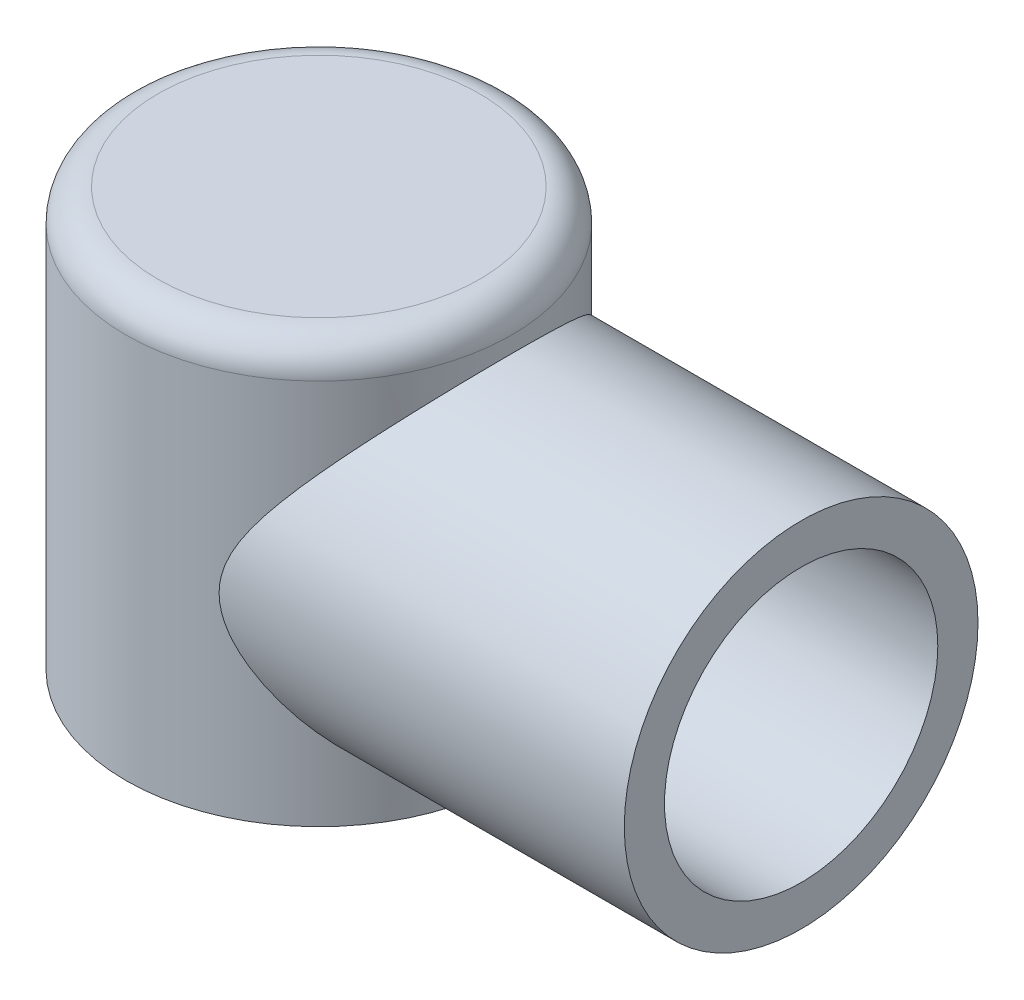
ISO-10303-21;
HEADER;
FILE_DESCRIPTION(('STEP AP214'),'2;1');
FILE_NAME('part.step','',(''),(''),'','','');
FILE_SCHEMA(('AUTOMOTIVE_DESIGN { 1 0 10303 214 1 1 1 1 }'));
ENDSEC;
DATA;
#1=APPLICATION_CONTEXT('core data for automotive mechanical design processes');
#2=APPLICATION_PROTOCOL_DEFINITION('international standard','automotive_design',2000,#1);
#3=PRODUCT_CONTEXT('',#1,'mechanical');
#4=PRODUCT('Part','Part','',(#3));
#5=PRODUCT_RELATED_PRODUCT_CATEGORY('part','',(#4));
#6=PRODUCT_DEFINITION_FORMATION('','',#4);
#7=PRODUCT_DEFINITION_CONTEXT('part definition',#1,'design');
#8=PRODUCT_DEFINITION('design','',#6,#7);
#9=PRODUCT_DEFINITION_SHAPE('','',#8);
#10=(LENGTH_UNIT() NAMED_UNIT(*) SI_UNIT(.MILLI.,.METRE.));
#11=(NAMED_UNIT(*) PLANE_ANGLE_UNIT() SI_UNIT($,.RADIAN.));
#12=(NAMED_UNIT(*) SI_UNIT($,.STERADIAN.) SOLID_ANGLE_UNIT());
#13=UNCERTAINTY_MEASURE_WITH_UNIT(LENGTH_MEASURE(1.E-05),#10,'distance_accuracy_value','');
#14=(GEOMETRIC_REPRESENTATION_CONTEXT(3) GLOBAL_UNCERTAINTY_ASSIGNED_CONTEXT((#13)) GLOBAL_UNIT_ASSIGNED_CONTEXT((#10,
#11,#12)) REPRESENTATION_CONTEXT('',''));
#15=CARTESIAN_POINT('',(0.,0.,0.));
#16=DIRECTION('',(0.,0.,1.));
#17=DIRECTION('',(1.,0.,0.));
#18=AXIS2_PLACEMENT_3D('',#15,#16,#17);
#19=CARTESIAN_POINT('',(0.,130.,0.));
#20=DIRECTION('',(0.,-1.,0.));
#21=DIRECTION('',(0.,0.,-1.));
#22=AXIS2_PLACEMENT_3D('',#19,#20,#21);
#23=CYLINDRICAL_SURFACE('',#22,60.);
#24=CARTESIAN_POINT('',(0.,120.,0.));
#25=DIRECTION('',(0.,1.,0.));
#26=DIRECTION('',(0.,0.,1.));
#27=AXIS2_PLACEMENT_3D('',#24,#25,#26);
#28=CIRCLE('',#27,60.);
#29=CARTESIAN_POINT('',(0.,120.,60.));
#30=VERTEX_POINT('',#29);
#31=EDGE_CURVE('E52',#30,#30,#28,.F.);
#32=ORIENTED_EDGE('',*,*,#31,.T.);
#33=EDGE_LOOP('',(#32));
#34=FACE_BOUND('',#33,.T.);
#35=CARTESIAN_POINT('',(0.,0.,0.));
#36=DIRECTION('',(0.,1.,0.));
#37=DIRECTION('',(0.,0.,1.));
#38=AXIS2_PLACEMENT_3D('',#35,#36,#37);
#39=CIRCLE('',#38,60.);
#40=CARTESIAN_POINT('',(0.,0.,60.));
#41=VERTEX_POINT('',#40);
#42=EDGE_CURVE('E62',#41,#41,#39,.T.);
#43=ORIENTED_EDGE('',*,*,#42,.T.);
#44=EDGE_LOOP('',(#43));
#45=FACE_BOUND('',#44,.T.);
#46=CARTESIAN_POINT('',(23.9791576165636,60.,55.));
#47=CARTESIAN_POINT('',(23.979162437425,59.2198035653742,54.9999987143601));
#48=CARTESIAN_POINT('',(24.017476494625,58.4395883592243,54.983341218657));
#49=CARTESIAN_POINT('',(24.1679322970251,56.8877656452296,54.9173702417873));
#50=CARTESIAN_POINT('',(24.2800846804916,56.116159394014,54.8680520550215));
#51=CARTESIAN_POINT('',(24.5713529489666,54.5852937637453,54.7382298783251));
#52=CARTESIAN_POINT('',(24.7507421102255,53.8260981504494,54.6575985707863));
#53=CARTESIAN_POINT('',(25.1664635645318,52.3273346758022,54.4674332856276));
#54=CARTESIAN_POINT('',(25.4028064991366,51.5877705112016,54.3578939062996));
#55=CARTESIAN_POINT('',(26.0545268603025,49.7580390376208,54.0495025077582));
#56=CARTESIAN_POINT('',(26.4997411921692,48.6814110194566,53.8335914716955));
#57=CARTESIAN_POINT('',(27.4653386742128,46.575310158128,53.3474243629048));
#58=CARTESIAN_POINT('',(27.9857750042762,45.5458713603727,53.0771297890598));
#59=CARTESIAN_POINT('',(29.0799270909295,43.5268856591106,52.4856745009368));
#60=CARTESIAN_POINT('',(29.6538013341083,42.537470763524,52.1643603482076));
#61=CARTESIAN_POINT('',(30.8362814484345,40.5972323419943,51.4741936986878));
#62=CARTESIAN_POINT('',(31.4448815947431,39.6464024989751,51.1053490251334));
#63=CARTESIAN_POINT('',(32.626659881748,37.8663424183254,50.3581526396224));
#64=CARTESIAN_POINT('',(33.1978400958508,37.0340473825267,49.9839037002673));
#65=CARTESIAN_POINT('',(34.3518051458842,35.3954305247625,49.197976842127));
#66=CARTESIAN_POINT('',(34.9345915245324,34.5891121934724,48.7862939212472));
#67=CARTESIAN_POINT('',(36.1065180833197,33.0005905916073,47.9254465555496));
#68=CARTESIAN_POINT('',(36.6956620097754,32.2184027206045,47.4762588269192));
#69=CARTESIAN_POINT('',(37.8753618469117,30.6778531023219,46.5405609500231));
#70=CARTESIAN_POINT('',(38.4659176892249,29.919490225569,46.0540525747946));
#71=CARTESIAN_POINT('',(39.6438980844781,28.4270968866424,45.0440082192895));
#72=CARTESIAN_POINT('',(40.2313254191558,27.6930399291412,44.5205146475802));
#73=CARTESIAN_POINT('',(41.4002592080546,26.2485343498267,43.4356357414679));
#74=CARTESIAN_POINT('',(41.9817655033489,25.5380863605505,42.8742493930522));
#75=CARTESIAN_POINT('',(43.1353447085372,24.1417710707971,41.7134420838728));
#76=CARTESIAN_POINT('',(43.7074220714056,23.4558919765582,41.1140397653209));
#77=CARTESIAN_POINT('',(44.8392714455423,22.1094592850917,39.8765959106842));
#78=CARTESIAN_POINT('',(45.3990443083972,21.4489039328548,39.238557060158));
#79=CARTESIAN_POINT('',(46.777429200811,19.8330505434128,37.5968461627698));
#80=CARTESIAN_POINT('',(47.5866198904488,18.89417979294,36.5688712200142));
#81=CARTESIAN_POINT('',(49.1602803371851,17.0822359961608,34.4243488531685));
#82=CARTESIAN_POINT('',(49.9247505600719,16.2091622645149,33.3078023518854));
#83=CARTESIAN_POINT('',(51.3969872907468,14.5378570476448,30.9876519427367));
#84=CARTESIAN_POINT('',(52.1048329152303,13.7395208625837,29.7841741376249));
#85=CARTESIAN_POINT('',(53.4532092253284,12.2259096398677,27.2903362846031));
#86=CARTESIAN_POINT('',(54.0937549112158,11.5106160893528,25.9999957029115));
#87=CARTESIAN_POINT('',(55.1741325161052,10.3085569776406,23.6045925728947));
#88=CARTESIAN_POINT('',(55.6284060519633,9.80477994899231,22.5145557989789));
#89=CARTESIAN_POINT('',(56.4796616948769,8.86299983490454,20.2847566509838));
#90=CARTESIAN_POINT('',(56.8766500845249,8.42498953646405,19.1449997477068));
#91=CARTESIAN_POINT('',(57.6067707148144,7.62091656663392,16.8209058075471));
#92=CARTESIAN_POINT('',(57.9399265009831,7.25482736489763,15.6365854021232));
#93=CARTESIAN_POINT('',(58.5364870828544,6.60020138656436,13.2293994008599));
#94=CARTESIAN_POINT('',(58.7998911227983,6.31166545025462,12.0065333875404));
#95=CARTESIAN_POINT('',(59.2531209270813,5.81566120442178,9.52220119069444));
#96=CARTESIAN_POINT('',(59.4424445936922,5.60874602531621,8.26053206017785));
#97=CARTESIAN_POINT('',(59.7407962130506,5.28284509068574,5.71641720651495));
#98=CARTESIAN_POINT('',(59.8498239489035,5.16385957267555,4.43397142725654));
#99=CARTESIAN_POINT('',(59.9850065687957,5.01634892686257,1.85994587298736));
#100=CARTESIAN_POINT('',(60.0111892269023,4.98779348209639,0.568369304672026));
#101=CARTESIAN_POINT('',(59.9801206344612,5.02168673440688,-2.01251535219679));
#102=CARTESIAN_POINT('',(59.9228760568316,5.08412815310959,-3.30182361392234));
#103=CARTESIAN_POINT('',(59.7367826126387,5.28725356724934,-5.7305885902129));
#104=CARTESIAN_POINT('',(59.6161616132024,5.41894814331486,-6.87145084058707));
#105=CARTESIAN_POINT('',(59.3116123036022,5.75175704685284,-9.13431659570586));
#106=CARTESIAN_POINT('',(59.1276894341741,5.95286540828041,-10.2563217125136));
#107=CARTESIAN_POINT('',(58.6997226563836,6.42139863676478,-12.4747354629525));
#108=CARTESIAN_POINT('',(58.4556736415395,6.68882913653841,-13.5711419138395));
#109=CARTESIAN_POINT('',(57.9114031697745,7.28619000701771,-15.7325000853598));
#110=CARTESIAN_POINT('',(57.6111784047662,7.61612405845766,-16.7974499492938));
#111=CARTESIAN_POINT('',(56.9443098249308,8.35042012002445,-18.9382822546182));
#112=CARTESIAN_POINT('',(56.575285165055,8.7574632070695,-20.0125002614585));
#113=CARTESIAN_POINT('',(55.7860885903214,9.63014428002924,-22.1173191994193));
#114=CARTESIAN_POINT('',(55.3659166525606,10.0957822921818,-23.1479201110086));
#115=CARTESIAN_POINT('',(54.4797533267458,11.0807831732536,-25.1628321796261));
#116=CARTESIAN_POINT('',(54.0137536125392,11.6001558057641,-26.1471348768305));
#117=CARTESIAN_POINT('',(53.041184268782,12.6879863876618,-28.0676258005477));
#118=CARTESIAN_POINT('',(52.5346060014864,13.2564547898335,-29.0038037129889));
#119=CARTESIAN_POINT('',(51.610185906837,14.2982000714731,-30.6109946765646));
#120=CARTESIAN_POINT('',(51.1997117160454,14.7621713013003,-31.2923334290266));
#121=CARTESIAN_POINT('',(50.3604251486031,15.7143044159422,-32.6258846311836));
#122=CARTESIAN_POINT('',(49.9316157794059,16.2024623355705,-33.2781018219792));
#123=CARTESIAN_POINT('',(48.620218339151,17.7015231620614,-35.1918435399239));
#124=CARTESIAN_POINT('',(47.7128829188417,18.7467638150326,-36.4100761400496));
#125=CARTESIAN_POINT('',(46.3138588348671,20.3761322686698,-38.1521173304389));
#126=CARTESIAN_POINT('',(45.8404133303581,20.9304179881995,-38.7193966024307));
#127=CARTESIAN_POINT('',(44.8830364246606,22.0582559913569,-39.8252127899782));
#128=CARTESIAN_POINT('',(44.3991060449911,22.6318064010362,-40.363752488022));
#129=CARTESIAN_POINT('',(43.4227765713875,23.797254593911,-41.4122643749033));
#130=CARTESIAN_POINT('',(42.930378625002,24.3891498995424,-41.922240395509));
#131=CARTESIAN_POINT('',(41.9390302840201,25.5907346438048,-42.9139749340406));
#132=CARTESIAN_POINT('',(41.4400802684208,26.2004230556858,-43.3957350753571));
#133=CARTESIAN_POINT('',(40.4252361805259,27.4525339037397,-44.3429123370808));
#134=CARTESIAN_POINT('',(39.9092283484572,28.095393024056,-44.8076300276969));
#135=CARTESIAN_POINT('',(38.8747774411009,29.3992506594808,-45.7080063659876));
#136=CARTESIAN_POINT('',(38.3563343434075,30.0602493417548,-46.1436647457387));
#137=CARTESIAN_POINT('',(37.3193470764127,31.4007998790186,-46.9863048764143));
#138=CARTESIAN_POINT('',(36.8008029677409,32.0803600042144,-47.3932735453823));
#139=CARTESIAN_POINT('',(35.7667662682481,33.458166412966,-48.1784162753619));
#140=CARTESIAN_POINT('',(35.2512736255824,34.1564123779276,-48.5565908268917));
#141=CARTESIAN_POINT('',(34.2280978071977,35.570502816494,-49.2831605444482));
#142=CARTESIAN_POINT('',(33.7203974785681,36.2862954232815,-49.6316323966726));
#143=CARTESIAN_POINT('',(32.7154320844475,37.7384998492391,-50.2997468106952));
#144=CARTESIAN_POINT('',(32.2181678149504,38.4749132312984,-50.6193871795059));
#145=CARTESIAN_POINT('',(31.2395916747544,39.9692539712422,-51.2290922441948));
#146=CARTESIAN_POINT('',(30.7582660601209,40.7271616889667,-51.5191828940875));
#147=CARTESIAN_POINT('',(29.8175712588878,42.2670000332903,-52.0692717399057));
#148=CARTESIAN_POINT('',(29.3581969463166,43.0489249807366,-52.3292769816014));
#149=CARTESIAN_POINT('',(28.5350390740215,44.5221325514991,-52.7819914719471));
#150=CARTESIAN_POINT('',(28.1671437209256,45.2097957000089,-52.9789716489651));
#151=CARTESIAN_POINT('',(27.4597493871078,46.6059669196435,-53.3490527065183));
#152=CARTESIAN_POINT('',(27.1202500072069,47.3144746975537,-53.5221539227563));
#153=CARTESIAN_POINT('',(26.4780900523133,48.752659657723,-53.8427283386352));
#154=CARTESIAN_POINT('',(26.1753827347168,49.4823084895531,-53.9902341601725));
#155=CARTESIAN_POINT('',(25.6159765180593,50.9640500777028,-54.2578841000666));
#156=CARTESIAN_POINT('',(25.3592690841366,51.7161386402633,-54.3780332953196));
#157=CARTESIAN_POINT('',(24.9421832297855,53.1098052050044,-54.5704211569959));
#158=CARTESIAN_POINT('',(24.7728249454927,53.7480328917303,-54.6473506687088));
#159=CARTESIAN_POINT('',(24.4793177434079,55.0370859468725,-54.7794579322649));
#160=CARTESIAN_POINT('',(24.3551633062482,55.6879097670804,-54.8346383397313));
#161=CARTESIAN_POINT('',(24.1577336986885,56.9976402733047,-54.9219050814068));
#162=CARTESIAN_POINT('',(24.0843654975985,57.6565299180778,-54.9540336461564));
#163=CARTESIAN_POINT('',(23.9918293188376,58.9788738151551,-54.9944974580273));
#164=CARTESIAN_POINT('',(23.9726597412551,59.6423279321391,-55.0028334074927));
#165=CARTESIAN_POINT('',(23.9895596570086,60.9696289569354,-54.9954643536278));
#166=CARTESIAN_POINT('',(24.0257324715581,61.6334742808527,-54.9797143832292));
#167=CARTESIAN_POINT('',(24.1515888349841,62.9550209291655,-54.9245426395032));
#168=CARTESIAN_POINT('',(24.2412744926587,63.6127220103953,-54.8851199332961));
#169=CARTESIAN_POINT('',(24.4700019984561,64.9188933103282,-54.7835243643776));
#170=CARTESIAN_POINT('',(24.6091381822646,65.5673434046304,-54.721308011688));
#171=CARTESIAN_POINT('',(24.9308572478882,66.8508346915879,-54.5754844977363));
#172=CARTESIAN_POINT('',(25.1134461386773,67.4858740164637,-54.4918743778596));
#173=CARTESIAN_POINT('',(25.6382013116228,69.1231924331075,-54.247668231115));
#174=CARTESIAN_POINT('',(26.0098438288736,70.1136764400744,-54.0711923046482));
#175=CARTESIAN_POINT('',(26.8243958588011,72.0551504546918,-53.6717569608795));
#176=CARTESIAN_POINT('',(27.2673581048796,73.0061105789264,-53.4487631121407));
#177=CARTESIAN_POINT('',(28.206250202373,74.8743705032699,-52.959313584383));
#178=CARTESIAN_POINT('',(28.7023749514203,75.7915286481811,-52.692695956035));
#179=CARTESIAN_POINT('',(29.7309171517263,77.5918448491104,-52.1192803346105));
#180=CARTESIAN_POINT('',(30.2633289738332,78.4750081455809,-51.8124885669076));
#181=CARTESIAN_POINT('',(31.3355351594321,80.1827281391232,-51.1709098354602));
#182=CARTESIAN_POINT('',(31.8745275675763,81.00825669974,-50.8373563793722));
#183=CARTESIAN_POINT('',(32.968384036327,82.6335029472805,-50.1349012710635));
#184=CARTESIAN_POINT('',(33.523250706263,83.433216344324,-49.7659937838382));
#185=CARTESIAN_POINT('',(34.6431481977294,85.0090992424875,-48.993016239822));
#186=CARTESIAN_POINT('',(35.2081859046056,85.7852517597751,-48.5889215937551));
#187=CARTESIAN_POINT('',(36.3431738445014,87.3146266012353,-47.7459262966142));
#188=CARTESIAN_POINT('',(36.9131237967737,88.0678502248467,-47.3070276230744));
#189=CARTESIAN_POINT('',(38.0536974079388,89.5518016456214,-46.3944970096957));
#190=CARTESIAN_POINT('',(38.6243206805027,90.2825388118366,-45.9208798214346));
#191=CARTESIAN_POINT('',(39.7630101756937,91.7220871345423,-44.9384970268172));
#192=CARTESIAN_POINT('',(40.3310763412557,92.4308978037678,-44.4297306401635));
#193=CARTESIAN_POINT('',(41.4612569019952,93.8260699611677,-43.3769560232498));
#194=CARTESIAN_POINT('',(42.0233739149045,94.5124416264636,-42.8329641126832));
#195=CARTESIAN_POINT('',(43.1389582056924,95.862431817354,-41.7091980774093));
#196=CARTESIAN_POINT('',(43.6924258689244,96.5260513582031,-41.1294255525606));
#197=CARTESIAN_POINT('',(45.131746399723,98.2388023701681,-39.5583998240049));
#198=CARTESIAN_POINT('',(46.0082663951701,99.2685712884909,-38.5372081913535));
#199=CARTESIAN_POINT('',(47.7192364568949,101.259962727674,-36.3971311274361));
#200=CARTESIAN_POINT('',(48.5536846772235,102.221582259148,-35.2782414154245));
#201=CARTESIAN_POINT('',(49.7636142717794,103.605815825415,-33.5273799107272));
#202=CARTESIAN_POINT('',(50.1597012718236,104.057228614792,-32.9321187137632));
#203=CARTESIAN_POINT('',(50.9366491570473,104.939805437072,-31.7171498820813));
#204=CARTESIAN_POINT('',(51.3175110707625,105.37097083814,-31.097443904377));
#205=CARTESIAN_POINT('',(52.062223135576,106.211611810512,-29.833915472305));
#206=CARTESIAN_POINT('',(52.4260787790847,106.621094390343,-29.1901009268301));
#207=CARTESIAN_POINT('',(53.1352603456256,107.417176105222,-27.8783113716318));
#208=CARTESIAN_POINT('',(53.4805816070418,107.803769485864,-27.21033035382));
#209=CARTESIAN_POINT('',(54.3355281558126,108.758759657549,-25.4761067583012));
#210=CARTESIAN_POINT('',(54.8308561957462,109.30997254363,-24.393204401002));
#211=CARTESIAN_POINT('',(55.765485370728,110.347193620666,-22.1734063033675));
#212=CARTESIAN_POINT('',(56.2047995428661,110.833216985693,-21.036523211766));
#213=CARTESIAN_POINT('',(56.8165041283053,111.508486499336,-19.2941479026951));
#214=CARTESIAN_POINT('',(57.0125311324451,111.724618987563,-18.7071695901925));
#215=CARTESIAN_POINT('',(57.3880056243319,112.13818864941,-17.5215095165428));
#216=CARTESIAN_POINT('',(57.5674558057006,112.335628860529,-16.922829676038));
#217=CARTESIAN_POINT('',(57.9089832704907,112.71106543166,-15.7144499026658));
#218=CARTESIAN_POINT('',(58.0710588939222,112.889059933832,-15.1047489233148));
#219=CARTESIAN_POINT('',(58.3770368780524,113.224836464891,-13.875261274749));
#220=CARTESIAN_POINT('',(58.5209384494889,113.382617615957,-13.2554741688329));
#221=CARTESIAN_POINT('',(58.7908415433024,113.678363723149,-12.0021246562362));
#222=CARTESIAN_POINT('',(58.9166985592262,113.816168792086,-11.3684933227568));
#223=CARTESIAN_POINT('',(59.1485228118021,114.069865973263,-10.0931818824138));
#224=CARTESIAN_POINT('',(59.2544881435469,114.185755986838,-9.45150101096527));
#225=CARTESIAN_POINT('',(59.4459075619963,114.395015518305,-8.16145045528329));
#226=CARTESIAN_POINT('',(59.5313621163725,114.488385549681,-7.51308092391143));
#227=CARTESIAN_POINT('',(59.6812578474193,114.652114534529,-6.21103075476512));
#228=CARTESIAN_POINT('',(59.7456992598309,114.722473746152,-5.55735017665826));
#229=CARTESIAN_POINT('',(59.8531560474415,114.839774272085,-4.24641487963301));
#230=CARTESIAN_POINT('',(59.8961805186025,114.886725527971,-3.58916179809234));
#231=CARTESIAN_POINT('',(59.9605755083931,114.956990565919,-2.27241091629565));
#232=CARTESIAN_POINT('',(59.9819484881448,114.980307034544,-1.6129133797193));
#233=CARTESIAN_POINT('',(60.0029124499048,115.003177427092,-0.293167857331997));
#234=CARTESIAN_POINT('',(60.0025040907582,115.002732069765,0.367080105175866));
#235=CARTESIAN_POINT('',(59.9799196340461,114.978093544881,1.68669619915568));
#236=CARTESIAN_POINT('',(59.9577441506922,114.953901047406,2.34606435492779));
#237=CARTESIAN_POINT('',(59.8666285395325,114.854479726818,4.16314669997393));
#238=CARTESIAN_POINT('',(59.7749502091033,114.754430730646,5.31853521063198));
#239=CARTESIAN_POINT('',(59.52619852563,114.482761147546,7.61343720043859));
#240=CARTESIAN_POINT('',(59.3691314850752,114.31114746932,8.75295220101154));
#241=CARTESIAN_POINT('',(58.9924554068982,113.899135089799,11.0089998453436));
#242=CARTESIAN_POINT('',(58.77284313485,113.658732831211,12.1255312973428));
#243=CARTESIAN_POINT('',(58.2748055756152,113.112761813414,14.329107830572));
#244=CARTESIAN_POINT('',(57.9963771123065,112.807189534962,15.4161513158492));
#245=CARTESIAN_POINT('',(57.3776495945714,112.12691383566,17.5813439158349));
#246=CARTESIAN_POINT('',(57.0360149580887,111.750714855244,18.6586394249653));
#247=CARTESIAN_POINT('',(56.3006769732061,110.939137311022,20.7722401247839));
#248=CARTESIAN_POINT('',(55.9069743726702,110.503759597213,21.8085459039393));
#249=CARTESIAN_POINT('',(55.0725958852547,109.578531616761,23.8372094904051));
#250=CARTESIAN_POINT('',(54.6319082435325,109.088667717289,24.8295562116097));
#251=CARTESIAN_POINT('',(53.7086886348033,108.059080233782,26.7680703628522));
#252=CARTESIAN_POINT('',(53.2261477969942,107.519346078137,27.7142279363419));
#253=CARTESIAN_POINT('',(52.3480340933796,106.533361898628,29.3310099893931));
#254=CARTESIAN_POINT('',(51.9603990000945,106.096926523536,30.0119929529646));
#255=CARTESIAN_POINT('',(51.1664284483201,105.200075287044,31.3464413524238));
#256=CARTESIAN_POINT('',(50.7600961600655,104.739663489278,31.9999114175881));
#257=CARTESIAN_POINT('',(49.5155391872419,103.324258035328,33.9195716057346));
#258=CARTESIAN_POINT('',(48.6519485704751,102.335311683131,35.1446577245506));
#259=CARTESIAN_POINT('',(46.8707851410275,100.275781142362,37.4873418412492));
#260=CARTESIAN_POINT('',(45.9530933517314,99.2050153647698,38.6046875242498));
#261=CARTESIAN_POINT('',(44.0797559722655,96.9915328307116,40.730588634476));
#262=CARTESIAN_POINT('',(43.1241161354574,95.8488269659302,41.7391604675638));
#263=CARTESIAN_POINT('',(41.6617198627469,94.0707414145341,43.1831650752288));
#264=CARTESIAN_POINT('',(41.1635146308204,93.4599482846637,43.6580819315217));
#265=CARTESIAN_POINT('',(40.1629525055289,92.2210554902605,44.5802642855273));
#266=CARTESIAN_POINT('',(39.6605955849488,91.5929557122164,45.0275296018159));
#267=CARTESIAN_POINT('',(38.6537997615963,90.3194381879083,45.89472004929));
#268=CARTESIAN_POINT('',(38.1493603151061,89.6740156404669,46.3146374878986));
#269=CARTESIAN_POINT('',(37.1409340982059,88.3658709276434,47.1271709661515));
#270=CARTESIAN_POINT('',(36.6369473230374,87.7031489463697,47.5197872961838));
#271=CARTESIAN_POINT('',(35.6329170598391,86.3610101442798,48.2772205022832));
#272=CARTESIAN_POINT('',(35.1328686780172,85.6816207338391,48.6420794408428));
#273=CARTESIAN_POINT('',(34.1390612603975,84.3043800803461,49.3446529396826));
#274=CARTESIAN_POINT('',(33.6453025117681,83.6065279987801,49.6823662642759));
#275=CARTESIAN_POINT('',(32.66815886516,82.1916723997556,50.3302571409125));
#276=CARTESIAN_POINT('',(32.1847684014846,81.4746796458175,50.6404497615601));
#277=CARTESIAN_POINT('',(31.232817442196,80.0197801547856,51.2330492747827));
#278=CARTESIAN_POINT('',(30.7642548469626,79.2818764069823,51.5154601132964));
#279=CARTESIAN_POINT('',(29.8451731227384,77.7789219109172,52.0533443073169));
#280=CARTESIAN_POINT('',(29.3947712958475,77.0137410167398,52.30865593601));
#281=CARTESIAN_POINT('',(28.5225146169219,75.4579698634589,52.7893363974387));
#282=CARTESIAN_POINT('',(28.1006597152985,74.6673796484976,53.0147052821884));
#283=CARTESIAN_POINT('',(27.2956531350916,73.058988262111,53.4336320590383));
#284=CARTESIAN_POINT('',(26.9124777306552,72.2412041856573,53.627209498143));
#285=CARTESIAN_POINT('',(26.1971890180347,70.5762606680246,53.9802405126797));
#286=CARTESIAN_POINT('',(25.8650651570816,69.7291073421983,54.1397011430113));
#287=CARTESIAN_POINT('',(25.3204183737613,68.158725948828,54.3962358167406));
#288=CARTESIAN_POINT('',(25.0971297354465,67.4402505629916,54.4993613734121));
#289=CARTESIAN_POINT('',(24.7048932698165,65.985154293214,54.678285169083));
#290=CARTESIAN_POINT('',(24.5359368768176,65.2485362892581,54.7540877158862));
#291=CARTESIAN_POINT('',(24.2618345244177,63.7638166743638,54.8760974729652));
#292=CARTESIAN_POINT('',(24.1564482466575,63.0157694139802,54.9224161801594));
#293=CARTESIAN_POINT('',(24.0151104527714,61.5118201873033,54.9843667426401));
#294=CARTESIAN_POINT('',(23.9791529457139,60.7559189043844,55.0000012456344));
#295=CARTESIAN_POINT('',(23.9791576165636,60.,55.));
#296=B_SPLINE_CURVE_WITH_KNOTS('',3,(#46,#47,#48,#49,#50,#51,#52,#53,#54,#55,#56,#57,#58,#59,
#60,#61,#62,#63,#64,#65,#66,#67,#68,#69,#70,#71,#72,#73,#74,#75,#76,#77,#78,#79,#80,#81,#82,#83,
#84,#85,#86,#87,#88,#89,#90,#91,#92,#93,#94,#95,#96,#97,#98,#99,#100,#101,#102,#103,#104,#105,
#106,#107,#108,#109,#110,#111,#112,#113,#114,#115,#116,#117,#118,#119,#120,#121,#122,#123,#124,
#125,#126,#127,#128,#129,#130,#131,#132,#133,#134,#135,#136,#137,#138,#139,#140,#141,#142,#143,
#144,#145,#146,#147,#148,#149,#150,#151,#152,#153,#154,#155,#156,#157,#158,#159,#160,#161,#162,
#163,#164,#165,#166,#167,#168,#169,#170,#171,#172,#173,#174,#175,#176,#177,#178,#179,#180,#181,
#182,#183,#184,#185,#186,#187,#188,#189,#190,#191,#192,#193,#194,#195,#196,#197,#198,#199,#200,
#201,#202,#203,#204,#205,#206,#207,#208,#209,#210,#211,#212,#213,#214,#215,#216,#217,#218,#219,
#220,#221,#222,#223,#224,#225,#226,#227,#228,#229,#230,#231,#232,#233,#234,#235,#236,#237,#238,
#239,#240,#241,#242,#243,#244,#245,#246,#247,#248,#249,#250,#251,#252,#253,#254,#255,#256,#257,
#258,#259,#260,#261,#262,#263,#264,#265,#266,#267,#268,#269,#270,#271,#272,#273,#274,#275,#276,
#277,#278,#279,#280,#281,#282,#283,#284,#285,#286,#287,#288,#289,#290,#291,#292,#293,#294,#295),
.UNSPECIFIED.,.T.,.F.,(4,2,2,2,2,2,2,2,2,2,2,2,2,2,2,2,2,2,2,2,2,2,2,2,2,2,2,2,2,2,2,2,2,2,2,2,
2,2,2,2,2,2,2,2,2,2,2,2,2,2,2,2,2,2,2,2,2,2,2,2,2,2,2,2,2,2,2,2,2,2,2,2,2,2,2,2,2,2,2,2,2,2,2,2,
2,2,2,2,2,2,2,2,2,2,2,2,2,2,2,2,2,2,2,2,2,2,2,2,2,2,2,2,2,2,2,2,2,2,2,2,2,2,2,2,4),(0.,
2.33955121680865,4.67943957854555,7.0289431364433,9.37888602939984,12.9272197946966,
16.4780745173499,20.0398178729076,23.6009757340536,26.8296497091594,30.058755749791,
33.2898816128808,36.5208540659083,39.7481800834237,42.9755924986287,46.2014343173854,
49.4270521702536,54.2535821902387,59.080061930305,63.899675775391,68.718213102736,
72.5662678073233,76.4139001657122,80.2601105284791,84.1063625631364,87.9782497442501,
91.8501473840273,95.7207468205803,99.5910366846606,103.051324836245,106.511315653579,
109.971600427461,113.432089035361,117.048294620357,120.664501824639,124.281367252314,
127.899004639712,130.660597617423,133.421739345665,138.94553966595,141.716085105906,
144.486361820654,147.256266013045,150.026010683111,152.864294943369,155.702605368671,
158.542201748038,161.381749743027,164.213729318199,167.045924118782,169.875609508406,
172.704630860539,175.116827302422,177.528989828938,179.93805505186,182.34667283069,
184.339254073532,186.331591941524,188.320270499486,190.308890352208,192.301227382253,
194.29364293016,196.289879949024,198.286393183449,201.498390093625,204.712772935613,
207.939371541011,211.165470743934,214.286747635601,217.408540568383,220.532532835112,
223.656347726367,226.778842945829,229.901407505656,233.022535616673,236.143524273673,
241.222702681023,246.302103749768,248.838215039283,251.374154710411,253.90926962388,
256.445019189252,260.377836418817,264.309736617416,266.275760948261,268.241465249402,
270.207357189652,272.17333447525,274.154268291451,276.135391713133,278.116469958406,
280.097525977709,282.077739905822,284.057728718026,286.037657639269,288.017530693669,
291.502961837631,294.988056583351,298.473331587868,301.958794848207,305.528705192274,
309.098564266471,312.669318562595,316.240831539661,318.930663938117,321.620041926037,
327.000168612359,332.392603544481,337.784224019538,340.54443942233,343.304672933213,
346.065679535519,348.826656765908,351.583363143582,354.340194937449,357.095507826232,
359.850428802029,362.620962143948,365.391490673051,368.160309310067,370.92855483786,
373.204517806563,375.480121784996,377.747068334492,380.013819262942),.UNSPECIFIED.);
#297=CARTESIAN_POINT('',(23.9791576165636,60.,55.));
#298=VERTEX_POINT('',#297);
#299=EDGE_CURVE('E10',#298,#298,#296,.T.);
#300=ORIENTED_EDGE('',*,*,#299,.F.);
#301=EDGE_LOOP('',(#300));
#302=FACE_BOUND('',#301,.T.);
#303=ADVANCED_FACE('F40',(#34,#45,#302),#23,.T.);
#304=CARTESIAN_POINT('',(0.,130.,0.));
#305=DIRECTION('',(0.,1.,0.));
#306=DIRECTION('',(0.,0.,1.));
#307=AXIS2_PLACEMENT_3D('',#304,#305,#306);
#308=PLANE('',#307);
#309=CARTESIAN_POINT('',(0.,130.,0.));
#310=DIRECTION('',(0.,1.,0.));
#311=DIRECTION('',(0.,0.,1.));
#312=AXIS2_PLACEMENT_3D('',#309,#310,#311);
#313=CIRCLE('',#312,50.);
#314=CARTESIAN_POINT('',(0.,130.,50.));
#315=VERTEX_POINT('',#314);
#316=EDGE_CURVE('E57',#315,#315,#313,.T.);
#317=ORIENTED_EDGE('',*,*,#316,.T.);
#318=EDGE_LOOP('',(#317));
#319=FACE_BOUND('',#318,.T.);
#320=ADVANCED_FACE('F100',(#319),#308,.T.);
#321=CARTESIAN_POINT('',(0.,0.,0.));
#322=DIRECTION('',(0.,1.,0.));
#323=DIRECTION('',(0.,0.,1.));
#324=AXIS2_PLACEMENT_3D('',#321,#322,#323);
#325=PLANE('',#324);
#326=ORIENTED_EDGE('',*,*,#42,.F.);
#327=EDGE_LOOP('',(#326));
#328=FACE_BOUND('',#327,.T.);
#329=ADVANCED_FACE('F95',(#328),#325,.F.);
#330=CARTESIAN_POINT('',(0.,120.,0.));
#331=DIRECTION('',(0.,1.,0.));
#332=DIRECTION('',(0.,0.,1.));
#333=AXIS2_PLACEMENT_3D('',#330,#331,#332);
#334=TOROIDAL_SURFACE('',#333,50.,10.);
#335=ORIENTED_EDGE('',*,*,#31,.F.);
#336=EDGE_LOOP('',(#335));
#337=FACE_BOUND('',#336,.T.);
#338=ORIENTED_EDGE('',*,*,#316,.F.);
#339=EDGE_LOOP('',(#338));
#340=FACE_BOUND('',#339,.T.);
#341=ADVANCED_FACE('F42',(#337,#340),#334,.T.);
#342=CARTESIAN_POINT('',(150.,60.,0.));
#343=DIRECTION('',(-1.,0.,0.));
#344=DIRECTION('',(0.,0.,1.));
#345=AXIS2_PLACEMENT_3D('',#342,#343,#344);
#346=CYLINDRICAL_SURFACE('',#345,55.);
#347=CARTESIAN_POINT('',(150.,60.,0.));
#348=DIRECTION('',(1.,0.,0.));
#349=DIRECTION('',(0.,0.,-1.));
#350=AXIS2_PLACEMENT_3D('',#347,#348,#349);
#351=CIRCLE('',#350,55.);
#352=CARTESIAN_POINT('',(150.,60.,-55.));
#353=VERTEX_POINT('',#352);
#354=EDGE_CURVE('E68',#353,#353,#351,.T.);
#355=ORIENTED_EDGE('',*,*,#354,.F.);
#356=EDGE_LOOP('',(#355));
#357=FACE_BOUND('',#356,.T.);
#358=ORIENTED_EDGE('',*,*,#299,.T.);
#359=EDGE_LOOP('',(#358));
#360=FACE_BOUND('',#359,.T.);
#361=ADVANCED_FACE('F87',(#357,#360),#346,.T.);
#362=CARTESIAN_POINT('',(150.,60.,0.));
#363=DIRECTION('',(1.,0.,0.));
#364=DIRECTION('',(0.,0.,-1.));
#365=AXIS2_PLACEMENT_3D('',#362,#363,#364);
#366=PLANE('',#365);
#367=CARTESIAN_POINT('',(150.,60.,0.));
#368=DIRECTION('',(1.,0.,0.));
#369=DIRECTION('',(0.,0.,-1.));
#370=AXIS2_PLACEMENT_3D('',#367,#368,#369);
#371=CIRCLE('',#370,42.5);
#372=CARTESIAN_POINT('',(150.,60.,-42.5));
#373=VERTEX_POINT('',#372);
#374=EDGE_CURVE('E72',#373,#373,#371,.T.);
#375=ORIENTED_EDGE('',*,*,#374,.F.);
#376=EDGE_LOOP('',(#375));
#377=FACE_BOUND('',#376,.T.);
#378=ORIENTED_EDGE('',*,*,#354,.T.);
#379=EDGE_LOOP('',(#378));
#380=FACE_BOUND('',#379,.T.);
#381=ADVANCED_FACE('F84',(#377,#380),#366,.T.);
#382=CARTESIAN_POINT('',(150.,60.,0.));
#383=DIRECTION('',(-1.,0.,0.));
#384=DIRECTION('',(0.,0.,1.));
#385=AXIS2_PLACEMENT_3D('',#382,#383,#384);
#386=CYLINDRICAL_SURFACE('',#385,42.5);
#387=ORIENTED_EDGE('',*,*,#374,.T.);
#388=EDGE_LOOP('',(#387));
#389=FACE_BOUND('',#388,.T.);
#390=CARTESIAN_POINT('',(0.,60.,0.));
#391=DIRECTION('',(1.,0.,0.));
#392=DIRECTION('',(0.,0.,-1.));
#393=AXIS2_PLACEMENT_3D('',#390,#391,#392);
#394=CIRCLE('',#393,42.5);
#395=CARTESIAN_POINT('',(0.,60.,-42.5));
#396=VERTEX_POINT('',#395);
#397=EDGE_CURVE('E73',#396,#396,#394,.T.);
#398=ORIENTED_EDGE('',*,*,#397,.F.);
#399=EDGE_LOOP('',(#398));
#400=FACE_BOUND('',#399,.T.);
#401=ADVANCED_FACE('F81',(#389,#400),#386,.F.);
#402=CARTESIAN_POINT('',(0.,60.,0.));
#403=DIRECTION('',(1.,0.,0.));
#404=DIRECTION('',(0.,0.,-1.));
#405=AXIS2_PLACEMENT_3D('',#402,#403,#404);
#406=PLANE('',#405);
#407=ORIENTED_EDGE('',*,*,#397,.T.);
#408=EDGE_LOOP('',(#407));
#409=FACE_BOUND('',#408,.T.);
#410=ADVANCED_FACE('F138',(#409),#406,.T.);
#411=CLOSED_SHELL('',(#303,#320,#329,#341,#361,#381,#401,#410));
#412=MANIFOLD_SOLID_BREP('B2',#411);
#413=ADVANCED_BREP_SHAPE_REPRESENTATION('',(#18,#412),#14);
#414=SHAPE_DEFINITION_REPRESENTATION(#9,#413);
ENDSEC;
END-ISO-10303-21;
